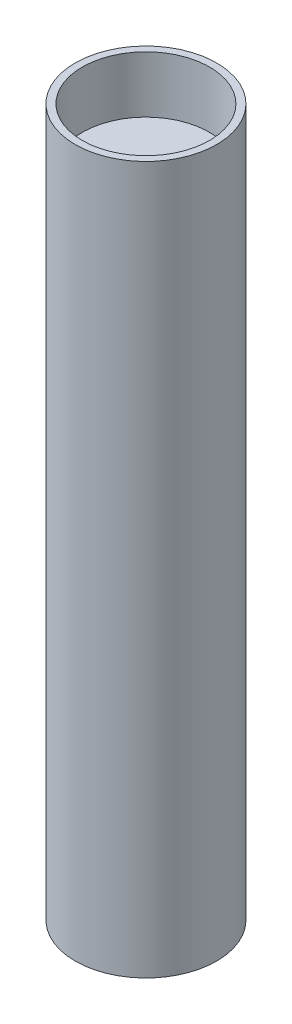
ISO-10303-21;
HEADER;
FILE_DESCRIPTION(('STEP AP214'),'2;1');
FILE_NAME('part.step','',(''),(''),'','','');
FILE_SCHEMA(('AUTOMOTIVE_DESIGN { 1 0 10303 214 1 1 1 1 }'));
ENDSEC;
DATA;
#1=APPLICATION_CONTEXT('core data for automotive mechanical design processes');
#2=APPLICATION_PROTOCOL_DEFINITION('international standard','automotive_design',2000,#1);
#3=PRODUCT_CONTEXT('',#1,'mechanical');
#4=PRODUCT('Part','Part','',(#3));
#5=PRODUCT_RELATED_PRODUCT_CATEGORY('part','',(#4));
#6=PRODUCT_DEFINITION_FORMATION('','',#4);
#7=PRODUCT_DEFINITION_CONTEXT('part definition',#1,'design');
#8=PRODUCT_DEFINITION('design','',#6,#7);
#9=PRODUCT_DEFINITION_SHAPE('','',#8);
#10=(LENGTH_UNIT() NAMED_UNIT(*) SI_UNIT(.MILLI.,.METRE.));
#11=(NAMED_UNIT(*) PLANE_ANGLE_UNIT() SI_UNIT($,.RADIAN.));
#12=(NAMED_UNIT(*) SI_UNIT($,.STERADIAN.) SOLID_ANGLE_UNIT());
#13=UNCERTAINTY_MEASURE_WITH_UNIT(LENGTH_MEASURE(1.E-05),#10,'distance_accuracy_value','');
#14=(GEOMETRIC_REPRESENTATION_CONTEXT(3) GLOBAL_UNCERTAINTY_ASSIGNED_CONTEXT((#13)) GLOBAL_UNIT_ASSIGNED_CONTEXT((#10,
#11,#12)) REPRESENTATION_CONTEXT('',''));
#15=CARTESIAN_POINT('',(0.,0.,0.));
#16=DIRECTION('',(0.,0.,1.));
#17=DIRECTION('',(1.,0.,0.));
#18=AXIS2_PLACEMENT_3D('',#15,#16,#17);
#19=CARTESIAN_POINT('',(0.,100.,0.));
#20=DIRECTION('',(0.,-1.,0.));
#21=DIRECTION('',(0.,0.,-1.));
#22=AXIS2_PLACEMENT_3D('',#19,#20,#21);
#23=CYLINDRICAL_SURFACE('',#22,10.);
#24=CARTESIAN_POINT('',(0.,100.,0.));
#25=DIRECTION('',(0.,1.,0.));
#26=DIRECTION('',(0.,0.,1.));
#27=AXIS2_PLACEMENT_3D('',#24,#25,#26);
#28=CIRCLE('',#27,10.);
#29=CARTESIAN_POINT('',(0.,100.,10.));
#30=VERTEX_POINT('',#29);
#31=EDGE_CURVE('E10',#30,#30,#28,.T.);
#32=ORIENTED_EDGE('',*,*,#31,.F.);
#33=EDGE_LOOP('',(#32));
#34=FACE_BOUND('',#33,.T.);
#35=CARTESIAN_POINT('',(0.,0.,0.));
#36=DIRECTION('',(0.,1.,0.));
#37=DIRECTION('',(0.,0.,1.));
#38=AXIS2_PLACEMENT_3D('',#35,#36,#37);
#39=CIRCLE('',#38,10.);
#40=CARTESIAN_POINT('',(0.,0.,10.));
#41=VERTEX_POINT('',#40);
#42=EDGE_CURVE('E36',#41,#41,#39,.T.);
#43=ORIENTED_EDGE('',*,*,#42,.T.);
#44=EDGE_LOOP('',(#43));
#45=FACE_BOUND('',#44,.T.);
#46=ADVANCED_FACE('F33',(#34,#45),#23,.T.);
#47=CARTESIAN_POINT('',(0.,100.,0.));
#48=DIRECTION('',(0.,1.,0.));
#49=DIRECTION('',(0.,0.,1.));
#50=AXIS2_PLACEMENT_3D('',#47,#48,#49);
#51=PLANE('',#50);
#52=CARTESIAN_POINT('',(0.,100.,0.));
#53=DIRECTION('',(0.,1.,0.));
#54=DIRECTION('',(0.,0.,1.));
#55=AXIS2_PLACEMENT_3D('',#52,#53,#54);
#56=CIRCLE('',#55,9.);
#57=CARTESIAN_POINT('',(0.,100.,9.));
#58=VERTEX_POINT('',#57);
#59=EDGE_CURVE('E45',#58,#58,#56,.T.);
#60=ORIENTED_EDGE('',*,*,#59,.F.);
#61=EDGE_LOOP('',(#60));
#62=FACE_BOUND('',#61,.T.);
#63=ORIENTED_EDGE('',*,*,#31,.T.);
#64=EDGE_LOOP('',(#63));
#65=FACE_BOUND('',#64,.T.);
#66=ADVANCED_FACE('F60',(#62,#65),#51,.T.);
#67=CARTESIAN_POINT('',(0.,0.,0.));
#68=DIRECTION('',(0.,1.,0.));
#69=DIRECTION('',(0.,0.,1.));
#70=AXIS2_PLACEMENT_3D('',#67,#68,#69);
#71=PLANE('',#70);
#72=ORIENTED_EDGE('',*,*,#42,.F.);
#73=EDGE_LOOP('',(#72));
#74=FACE_BOUND('',#73,.T.);
#75=ADVANCED_FACE('F56',(#74),#71,.F.);
#76=CARTESIAN_POINT('',(0.,92.,0.));
#77=DIRECTION('',(0.,1.,0.));
#78=DIRECTION('',(0.,0.,1.));
#79=AXIS2_PLACEMENT_3D('',#76,#77,#78);
#80=CYLINDRICAL_SURFACE('',#79,9.);
#81=CARTESIAN_POINT('',(0.,92.,0.));
#82=DIRECTION('',(0.,1.,0.));
#83=DIRECTION('',(0.,0.,1.));
#84=AXIS2_PLACEMENT_3D('',#81,#82,#83);
#85=CIRCLE('',#84,9.);
#86=CARTESIAN_POINT('',(0.,92.,9.));
#87=VERTEX_POINT('',#86);
#88=EDGE_CURVE('E43',#87,#87,#85,.T.);
#89=ORIENTED_EDGE('',*,*,#88,.F.);
#90=EDGE_LOOP('',(#89));
#91=FACE_BOUND('',#90,.T.);
#92=ORIENTED_EDGE('',*,*,#59,.T.);
#93=EDGE_LOOP('',(#92));
#94=FACE_BOUND('',#93,.T.);
#95=ADVANCED_FACE('F53',(#91,#94),#80,.F.);
#96=CARTESIAN_POINT('',(0.,92.,0.));
#97=DIRECTION('',(0.,1.,0.));
#98=DIRECTION('',(0.,0.,1.));
#99=AXIS2_PLACEMENT_3D('',#96,#97,#98);
#100=PLANE('',#99);
#101=ORIENTED_EDGE('',*,*,#88,.T.);
#102=EDGE_LOOP('',(#101));
#103=FACE_BOUND('',#102,.T.);
#104=ADVANCED_FACE('F51',(#103),#100,.T.);
#105=CLOSED_SHELL('',(#46,#66,#75,#95,#104));
#106=MANIFOLD_SOLID_BREP('B2',#105);
#107=ADVANCED_BREP_SHAPE_REPRESENTATION('',(#18,#106),#14);
#108=SHAPE_DEFINITION_REPRESENTATION(#9,#107);
ENDSEC;
END-ISO-10303-21;
